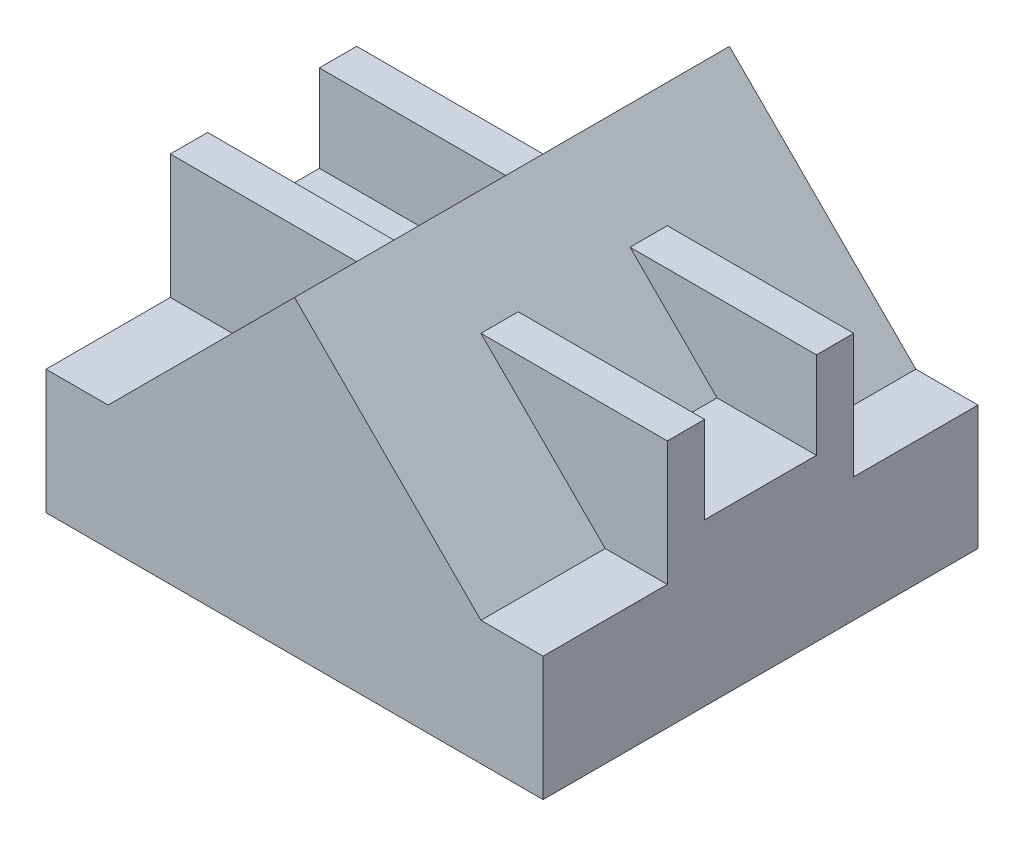
ISO-10303-21;
HEADER;
FILE_DESCRIPTION(('STEP AP214'),'2;1');
FILE_NAME('part.step','',(''),(''),'','','');
FILE_SCHEMA(('AUTOMOTIVE_DESIGN { 1 0 10303 214 1 1 1 1 }'));
ENDSEC;
DATA;
#1=APPLICATION_CONTEXT('core data for automotive mechanical design processes');
#2=APPLICATION_PROTOCOL_DEFINITION('international standard','automotive_design',2000,#1);
#3=PRODUCT_CONTEXT('',#1,'mechanical');
#4=PRODUCT('Part','Part','',(#3));
#5=PRODUCT_RELATED_PRODUCT_CATEGORY('part','',(#4));
#6=PRODUCT_DEFINITION_FORMATION('','',#4);
#7=PRODUCT_DEFINITION_CONTEXT('part definition',#1,'design');
#8=PRODUCT_DEFINITION('design','',#6,#7);
#9=PRODUCT_DEFINITION_SHAPE('','',#8);
#10=(LENGTH_UNIT() NAMED_UNIT(*) SI_UNIT(.MILLI.,.METRE.));
#11=(NAMED_UNIT(*) PLANE_ANGLE_UNIT() SI_UNIT($,.RADIAN.));
#12=(NAMED_UNIT(*) SI_UNIT($,.STERADIAN.) SOLID_ANGLE_UNIT());
#13=UNCERTAINTY_MEASURE_WITH_UNIT(LENGTH_MEASURE(1.E-05),#10,'distance_accuracy_value','');
#14=(GEOMETRIC_REPRESENTATION_CONTEXT(3) GLOBAL_UNCERTAINTY_ASSIGNED_CONTEXT((#13)) GLOBAL_UNIT_ASSIGNED_CONTEXT((#10,
#11,#12)) REPRESENTATION_CONTEXT('',''));
#15=CARTESIAN_POINT('',(0.,0.,0.));
#16=DIRECTION('',(0.,0.,1.));
#17=DIRECTION('',(1.,0.,0.));
#18=AXIS2_PLACEMENT_3D('',#15,#16,#17);
#19=CARTESIAN_POINT('',(74.9999999999992,25.,175.));
#20=DIRECTION('',(0.,-1.,0.));
#21=DIRECTION('',(1.,0.,0.));
#22=AXIS2_PLACEMENT_3D('',#19,#20,#21);
#23=PLANE('',#22);
#24=DIRECTION('',(0.,0.,-1.));
#25=VECTOR('',#24,1.);
#26=CARTESIAN_POINT('',(100.,25.,175.));
#27=LINE('',#26,#25);
#28=CARTESIAN_POINT('',(100.,25.,175.));
#29=VERTEX_POINT('',#28);
#30=CARTESIAN_POINT('',(100.,25.,125.));
#31=VERTEX_POINT('',#30);
#32=EDGE_CURVE('E409',#29,#31,#27,.T.);
#33=ORIENTED_EDGE('',*,*,#32,.T.);
#34=DIRECTION('',(1.,0.,0.));
#35=VECTOR('',#34,1.);
#36=CARTESIAN_POINT('',(-100.,25.,125.));
#37=LINE('',#36,#35);
#38=CARTESIAN_POINT('',(74.9999999999992,25.,125.));
#39=VERTEX_POINT('',#38);
#40=EDGE_CURVE('E275',#39,#31,#37,.T.);
#41=ORIENTED_EDGE('',*,*,#40,.F.);
#42=DIRECTION('',(0.,0.,-1.));
#43=VECTOR('',#42,1.);
#44=CARTESIAN_POINT('',(74.9999999999992,25.,175.));
#45=LINE('',#44,#43);
#46=CARTESIAN_POINT('',(74.9999999999992,25.,175.));
#47=VERTEX_POINT('',#46);
#48=EDGE_CURVE('E404',#47,#39,#45,.T.);
#49=ORIENTED_EDGE('',*,*,#48,.F.);
#50=DIRECTION('',(-1.,0.,0.));
#51=VECTOR('',#50,1.);
#52=CARTESIAN_POINT('',(74.9999999999992,25.,175.));
#53=LINE('',#52,#51);
#54=EDGE_CURVE('E339',#29,#47,#53,.T.);
#55=ORIENTED_EDGE('',*,*,#54,.F.);
#56=EDGE_LOOP('',(#33,#41,#49,#55));
#57=FACE_BOUND('',#56,.T.);
#58=ADVANCED_FACE('F43',(#57),#23,.F.);
#59=CARTESIAN_POINT('',(-100.,25.,175.));
#60=DIRECTION('',(0.,-1.,0.));
#61=DIRECTION('',(1.,0.,0.));
#62=AXIS2_PLACEMENT_3D('',#59,#60,#61);
#63=PLANE('',#62);
#64=DIRECTION('',(0.,0.,-1.));
#65=VECTOR('',#64,1.);
#66=CARTESIAN_POINT('',(-74.9999999999992,25.,175.));
#67=LINE('',#66,#65);
#68=CARTESIAN_POINT('',(-74.9999999999992,25.,175.));
#69=VERTEX_POINT('',#68);
#70=CARTESIAN_POINT('',(-74.9999999999992,25.,125.));
#71=VERTEX_POINT('',#70);
#72=EDGE_CURVE('E395',#69,#71,#67,.T.);
#73=ORIENTED_EDGE('',*,*,#72,.T.);
#74=CARTESIAN_POINT('',(-100.,25.,125.));
#75=VERTEX_POINT('',#74);
#76=EDGE_CURVE('E271',#75,#71,#37,.T.);
#77=ORIENTED_EDGE('',*,*,#76,.F.);
#78=DIRECTION('',(0.,0.,-1.));
#79=VECTOR('',#78,1.);
#80=CARTESIAN_POINT('',(-100.,25.,175.));
#81=LINE('',#80,#79);
#82=CARTESIAN_POINT('',(-100.,25.,175.));
#83=VERTEX_POINT('',#82);
#84=EDGE_CURVE('E390',#83,#75,#81,.T.);
#85=ORIENTED_EDGE('',*,*,#84,.F.);
#86=DIRECTION('',(-1.,0.,0.));
#87=VECTOR('',#86,1.);
#88=CARTESIAN_POINT('',(-100.,25.,175.));
#89=LINE('',#88,#87);
#90=EDGE_CURVE('E349',#69,#83,#89,.T.);
#91=ORIENTED_EDGE('',*,*,#90,.F.);
#92=EDGE_LOOP('',(#73,#77,#85,#91));
#93=FACE_BOUND('',#92,.T.);
#94=ADVANCED_FACE('F511',(#93),#63,.F.);
#95=CARTESIAN_POINT('',(100.,25.,175.));
#96=DIRECTION('',(-1.,0.,0.));
#97=DIRECTION('',(0.,0.,1.));
#98=AXIS2_PLACEMENT_3D('',#95,#96,#97);
#99=PLANE('',#98);
#100=DIRECTION('',(0.,1.,0.));
#101=VECTOR('',#100,1.);
#102=CARTESIAN_POINT('',(100.,25.,0.));
#103=LINE('',#102,#101);
#104=CARTESIAN_POINT('',(100.,-25.,0.));
#105=VERTEX_POINT('',#104);
#106=CARTESIAN_POINT('',(100.,25.,0.));
#107=VERTEX_POINT('',#106);
#108=EDGE_CURVE('E334',#105,#107,#103,.T.);
#109=ORIENTED_EDGE('',*,*,#108,.T.);
#110=CARTESIAN_POINT('',(100.,25.,50.));
#111=VERTEX_POINT('',#110);
#112=EDGE_CURVE('E408',#111,#107,#27,.T.);
#113=ORIENTED_EDGE('',*,*,#112,.F.);
#114=DIRECTION('',(0.,1.,0.));
#115=VECTOR('',#114,1.);
#116=CARTESIAN_POINT('',(100.,75.,50.));
#117=LINE('',#116,#115);
#118=CARTESIAN_POINT('',(100.,75.,50.));
#119=VERTEX_POINT('',#118);
#120=EDGE_CURVE('E248',#111,#119,#117,.T.);
#121=ORIENTED_EDGE('',*,*,#120,.T.);
#122=DIRECTION('',(0.,0.,1.));
#123=VECTOR('',#122,1.);
#124=CARTESIAN_POINT('',(100.,75.,65.));
#125=LINE('',#124,#123);
#126=CARTESIAN_POINT('',(100.,75.,65.));
#127=VERTEX_POINT('',#126);
#128=EDGE_CURVE('E252',#119,#127,#125,.T.);
#129=ORIENTED_EDGE('',*,*,#128,.T.);
#130=DIRECTION('',(0.,-1.,0.));
#131=VECTOR('',#130,1.);
#132=CARTESIAN_POINT('',(100.,40.,65.));
#133=LINE('',#132,#131);
#134=CARTESIAN_POINT('',(100.,40.,65.));
#135=VERTEX_POINT('',#134);
#136=EDGE_CURVE('E256',#127,#135,#133,.T.);
#137=ORIENTED_EDGE('',*,*,#136,.T.);
#138=DIRECTION('',(0.,0.,1.));
#139=VECTOR('',#138,1.);
#140=CARTESIAN_POINT('',(100.,40.,110.));
#141=LINE('',#140,#139);
#142=CARTESIAN_POINT('',(100.,40.,110.));
#143=VERTEX_POINT('',#142);
#144=EDGE_CURVE('E260',#135,#143,#141,.T.);
#145=ORIENTED_EDGE('',*,*,#144,.T.);
#146=DIRECTION('',(0.,1.,0.));
#147=VECTOR('',#146,1.);
#148=CARTESIAN_POINT('',(100.,75.,110.));
#149=LINE('',#148,#147);
#150=CARTESIAN_POINT('',(100.,75.,110.));
#151=VERTEX_POINT('',#150);
#152=EDGE_CURVE('E264',#143,#151,#149,.T.);
#153=ORIENTED_EDGE('',*,*,#152,.T.);
#154=DIRECTION('',(0.,0.,1.));
#155=VECTOR('',#154,1.);
#156=CARTESIAN_POINT('',(100.,75.,125.));
#157=LINE('',#156,#155);
#158=CARTESIAN_POINT('',(100.,75.,125.));
#159=VERTEX_POINT('',#158);
#160=EDGE_CURVE('E228',#151,#159,#157,.T.);
#161=ORIENTED_EDGE('',*,*,#160,.T.);
#162=DIRECTION('',(0.,-1.,0.));
#163=VECTOR('',#162,1.);
#164=CARTESIAN_POINT('',(100.,25.,125.));
#165=LINE('',#164,#163);
#166=EDGE_CURVE('E224',#159,#31,#165,.T.);
#167=ORIENTED_EDGE('',*,*,#166,.T.);
#168=ORIENTED_EDGE('',*,*,#32,.F.);
#169=DIRECTION('',(0.,1.,0.));
#170=VECTOR('',#169,1.);
#171=CARTESIAN_POINT('',(100.,25.,175.));
#172=LINE('',#171,#170);
#173=CARTESIAN_POINT('',(100.,-25.,175.));
#174=VERTEX_POINT('',#173);
#175=EDGE_CURVE('E335',#174,#29,#172,.T.);
#176=ORIENTED_EDGE('',*,*,#175,.F.);
#177=DIRECTION('',(0.,0.,-1.));
#178=VECTOR('',#177,1.);
#179=CARTESIAN_POINT('',(100.,-25.,175.));
#180=LINE('',#179,#178);
#181=EDGE_CURVE('E358',#174,#105,#180,.T.);
#182=ORIENTED_EDGE('',*,*,#181,.T.);
#183=EDGE_LOOP('',(#109,#113,#121,#129,#137,#145,#153,#161,#167,#168,#176,#182));
#184=FACE_BOUND('',#183,.T.);
#185=ADVANCED_FACE('F45',(#184),#99,.F.);
#186=CARTESIAN_POINT('',(74.9999999999992,25.,50.));
#187=VERTEX_POINT('',#186);
#188=CARTESIAN_POINT('',(74.9999999999992,25.,0.));
#189=VERTEX_POINT('',#188);
#190=EDGE_CURVE('E403',#187,#189,#45,.T.);
#191=ORIENTED_EDGE('',*,*,#190,.F.);
#192=DIRECTION('',(1.,0.,0.));
#193=VECTOR('',#192,1.);
#194=CARTESIAN_POINT('',(-100.,25.,50.));
#195=LINE('',#194,#193);
#196=EDGE_CURVE('E59',#187,#111,#195,.T.);
#197=ORIENTED_EDGE('',*,*,#196,.T.);
#198=ORIENTED_EDGE('',*,*,#112,.T.);
#199=DIRECTION('',(-1.,0.,0.));
#200=VECTOR('',#199,1.);
#201=CARTESIAN_POINT('',(74.9999999999992,25.,0.));
#202=LINE('',#201,#200);
#203=EDGE_CURVE('E362',#107,#189,#202,.T.);
#204=ORIENTED_EDGE('',*,*,#203,.T.);
#205=EDGE_LOOP('',(#191,#197,#198,#204));
#206=FACE_BOUND('',#205,.T.);
#207=ADVANCED_FACE('F452',(#206),#23,.F.);
#208=CARTESIAN_POINT('',(0.,100.,175.));
#209=DIRECTION('',(-0.707106781186551,-0.707106781186544,0.));
#210=DIRECTION('',(0.707106781186544,-0.707106781186551,0.));
#211=AXIS2_PLACEMENT_3D('',#208,#209,#210);
#212=PLANE('',#211);
#213=ORIENTED_EDGE('',*,*,#48,.T.);
#214=DIRECTION('',(-0.707106781186544,0.707106781186551,0.));
#215=VECTOR('',#214,1.);
#216=CARTESIAN_POINT('',(0.,100.,125.));
#217=LINE('',#216,#215);
#218=CARTESIAN_POINT('',(24.9999999999998,75.,125.));
#219=VERTEX_POINT('',#218);
#220=EDGE_CURVE('E310',#39,#219,#217,.T.);
#221=ORIENTED_EDGE('',*,*,#220,.T.);
#222=DIRECTION('',(0.,0.,-1.));
#223=VECTOR('',#222,1.);
#224=CARTESIAN_POINT('',(24.9999999999998,75.,175.));
#225=LINE('',#224,#223);
#226=CARTESIAN_POINT('',(24.9999999999997,75.,110.));
#227=VERTEX_POINT('',#226);
#228=EDGE_CURVE('E330',#219,#227,#225,.T.);
#229=ORIENTED_EDGE('',*,*,#228,.T.);
#230=DIRECTION('',(0.707106781186544,-0.707106781186551,0.));
#231=VECTOR('',#230,1.);
#232=CARTESIAN_POINT('',(0.,100.,110.));
#233=LINE('',#232,#231);
#234=CARTESIAN_POINT('',(59.9999999999994,40.,110.));
#235=VERTEX_POINT('',#234);
#236=EDGE_CURVE('E326',#227,#235,#233,.T.);
#237=ORIENTED_EDGE('',*,*,#236,.T.);
#238=DIRECTION('',(0.,0.,-1.));
#239=VECTOR('',#238,1.);
#240=CARTESIAN_POINT('',(59.9999999999994,40.,175.));
#241=LINE('',#240,#239);
#242=CARTESIAN_POINT('',(59.9999999999994,40.,65.));
#243=VERTEX_POINT('',#242);
#244=EDGE_CURVE('E322',#235,#243,#241,.T.);
#245=ORIENTED_EDGE('',*,*,#244,.T.);
#246=DIRECTION('',(-0.707106781186544,0.707106781186551,0.));
#247=VECTOR('',#246,1.);
#248=CARTESIAN_POINT('',(0.,100.,65.));
#249=LINE('',#248,#247);
#250=CARTESIAN_POINT('',(24.9999999999998,75.,65.));
#251=VERTEX_POINT('',#250);
#252=EDGE_CURVE('E318',#243,#251,#249,.T.);
#253=ORIENTED_EDGE('',*,*,#252,.T.);
#254=DIRECTION('',(0.,0.,-1.));
#255=VECTOR('',#254,1.);
#256=CARTESIAN_POINT('',(24.9999999999998,75.,175.));
#257=LINE('',#256,#255);
#258=CARTESIAN_POINT('',(24.9999999999998,75.,50.));
#259=VERTEX_POINT('',#258);
#260=EDGE_CURVE('E314',#251,#259,#257,.T.);
#261=ORIENTED_EDGE('',*,*,#260,.T.);
#262=DIRECTION('',(0.707106781186544,-0.707106781186551,0.));
#263=VECTOR('',#262,1.);
#264=CARTESIAN_POINT('',(0.,100.,50.));
#265=LINE('',#264,#263);
#266=EDGE_CURVE('E303',#259,#187,#265,.T.);
#267=ORIENTED_EDGE('',*,*,#266,.T.);
#268=ORIENTED_EDGE('',*,*,#190,.T.);
#269=DIRECTION('',(-0.707106781186544,0.707106781186551,0.));
#270=VECTOR('',#269,1.);
#271=CARTESIAN_POINT('',(0.,100.,0.));
#272=LINE('',#271,#270);
#273=CARTESIAN_POINT('',(0.,100.,0.));
#274=VERTEX_POINT('',#273);
#275=EDGE_CURVE('E366',#189,#274,#272,.T.);
#276=ORIENTED_EDGE('',*,*,#275,.T.);
#277=DIRECTION('',(0.,0.,-1.));
#278=VECTOR('',#277,1.);
#279=CARTESIAN_POINT('',(0.,100.,175.));
#280=LINE('',#279,#278);
#281=CARTESIAN_POINT('',(0.,100.,175.));
#282=VERTEX_POINT('',#281);
#283=EDGE_CURVE('E399',#282,#274,#280,.T.);
#284=ORIENTED_EDGE('',*,*,#283,.F.);
#285=DIRECTION('',(-0.707106781186544,0.707106781186551,0.));
#286=VECTOR('',#285,1.);
#287=CARTESIAN_POINT('',(0.,100.,175.));
#288=LINE('',#287,#286);
#289=EDGE_CURVE('E343',#47,#282,#288,.T.);
#290=ORIENTED_EDGE('',*,*,#289,.F.);
#291=EDGE_LOOP('',(#213,#221,#229,#237,#245,#253,#261,#267,#268,#276,#284,#290));
#292=FACE_BOUND('',#291,.T.);
#293=ADVANCED_FACE('F459',(#292),#212,.F.);
#294=CARTESIAN_POINT('',(0.,100.,175.));
#295=DIRECTION('',(0.707106781186551,-0.707106781186544,0.));
#296=DIRECTION('',(0.707106781186544,0.707106781186551,0.));
#297=AXIS2_PLACEMENT_3D('',#294,#295,#296);
#298=PLANE('',#297);
#299=DIRECTION('',(0.,0.,1.));
#300=VECTOR('',#299,1.);
#301=CARTESIAN_POINT('',(-24.9999999999997,75.,175.));
#302=LINE('',#301,#300);
#303=CARTESIAN_POINT('',(-24.9999999999997,75.,110.));
#304=VERTEX_POINT('',#303);
#305=CARTESIAN_POINT('',(-24.9999999999997,75.,125.));
#306=VERTEX_POINT('',#305);
#307=EDGE_CURVE('E11',#304,#306,#302,.T.);
#308=ORIENTED_EDGE('',*,*,#307,.T.);
#309=DIRECTION('',(-0.707106781186544,-0.707106781186551,0.));
#310=VECTOR('',#309,1.);
#311=CARTESIAN_POINT('',(0.,100.,125.));
#312=LINE('',#311,#310);
#313=EDGE_CURVE('E306',#306,#71,#312,.T.);
#314=ORIENTED_EDGE('',*,*,#313,.T.);
#315=ORIENTED_EDGE('',*,*,#72,.F.);
#316=DIRECTION('',(-0.707106781186544,-0.707106781186551,0.));
#317=VECTOR('',#316,1.);
#318=CARTESIAN_POINT('',(0.,100.,175.));
#319=LINE('',#318,#317);
#320=EDGE_CURVE('E346',#282,#69,#319,.T.);
#321=ORIENTED_EDGE('',*,*,#320,.F.);
#322=ORIENTED_EDGE('',*,*,#283,.T.);
#323=DIRECTION('',(-0.707106781186544,-0.707106781186551,0.));
#324=VECTOR('',#323,1.);
#325=CARTESIAN_POINT('',(0.,100.,0.));
#326=LINE('',#325,#324);
#327=CARTESIAN_POINT('',(-74.9999999999992,25.,0.));
#328=VERTEX_POINT('',#327);
#329=EDGE_CURVE('E369',#274,#328,#326,.T.);
#330=ORIENTED_EDGE('',*,*,#329,.T.);
#331=CARTESIAN_POINT('',(-74.9999999999992,25.,50.));
#332=VERTEX_POINT('',#331);
#333=EDGE_CURVE('E394',#332,#328,#67,.T.);
#334=ORIENTED_EDGE('',*,*,#333,.F.);
#335=DIRECTION('',(0.707106781186544,0.707106781186551,0.));
#336=VECTOR('',#335,1.);
#337=CARTESIAN_POINT('',(0.,100.,50.));
#338=LINE('',#337,#336);
#339=CARTESIAN_POINT('',(-24.9999999999997,75.,50.));
#340=VERTEX_POINT('',#339);
#341=EDGE_CURVE('E274',#332,#340,#338,.T.);
#342=ORIENTED_EDGE('',*,*,#341,.T.);
#343=DIRECTION('',(0.,0.,1.));
#344=VECTOR('',#343,1.);
#345=CARTESIAN_POINT('',(-24.9999999999997,75.,175.));
#346=LINE('',#345,#344);
#347=CARTESIAN_POINT('',(-24.9999999999997,75.,65.));
#348=VERTEX_POINT('',#347);
#349=EDGE_CURVE('E205',#340,#348,#346,.T.);
#350=ORIENTED_EDGE('',*,*,#349,.T.);
#351=DIRECTION('',(-0.707106781186544,-0.707106781186551,0.));
#352=VECTOR('',#351,1.);
#353=CARTESIAN_POINT('',(0.,100.,65.));
#354=LINE('',#353,#352);
#355=CARTESIAN_POINT('',(-59.9999999999993,40.,65.));
#356=VERTEX_POINT('',#355);
#357=EDGE_CURVE('E415',#348,#356,#354,.T.);
#358=ORIENTED_EDGE('',*,*,#357,.T.);
#359=DIRECTION('',(0.,0.,1.));
#360=VECTOR('',#359,1.);
#361=CARTESIAN_POINT('',(-59.9999999999993,40.,175.));
#362=LINE('',#361,#360);
#363=CARTESIAN_POINT('',(-59.9999999999993,40.,110.));
#364=VERTEX_POINT('',#363);
#365=EDGE_CURVE('E419',#356,#364,#362,.T.);
#366=ORIENTED_EDGE('',*,*,#365,.T.);
#367=DIRECTION('',(0.707106781186544,0.707106781186551,0.));
#368=VECTOR('',#367,1.);
#369=CARTESIAN_POINT('',(0.,100.,110.));
#370=LINE('',#369,#368);
#371=EDGE_CURVE('E52',#364,#304,#370,.T.);
#372=ORIENTED_EDGE('',*,*,#371,.T.);
#373=EDGE_LOOP('',(#308,#314,#315,#321,#322,#330,#334,#342,#350,#358,#366,#372));
#374=FACE_BOUND('',#373,.T.);
#375=ADVANCED_FACE('F425',(#374),#298,.F.);
#376=CARTESIAN_POINT('',(-100.,25.,50.));
#377=VERTEX_POINT('',#376);
#378=CARTESIAN_POINT('',(-100.,25.,0.));
#379=VERTEX_POINT('',#378);
#380=EDGE_CURVE('E389',#377,#379,#81,.T.);
#381=ORIENTED_EDGE('',*,*,#380,.F.);
#382=EDGE_CURVE('E221',#377,#332,#195,.T.);
#383=ORIENTED_EDGE('',*,*,#382,.T.);
#384=ORIENTED_EDGE('',*,*,#333,.T.);
#385=DIRECTION('',(-1.,0.,0.));
#386=VECTOR('',#385,1.);
#387=CARTESIAN_POINT('',(-100.,25.,0.));
#388=LINE('',#387,#386);
#389=EDGE_CURVE('E373',#328,#379,#388,.T.);
#390=ORIENTED_EDGE('',*,*,#389,.T.);
#391=EDGE_LOOP('',(#381,#383,#384,#390));
#392=FACE_BOUND('',#391,.T.);
#393=ADVANCED_FACE('F436',(#392),#63,.F.);
#394=CARTESIAN_POINT('',(-100.,25.,175.));
#395=DIRECTION('',(1.,0.,0.));
#396=DIRECTION('',(0.,0.,-1.));
#397=AXIS2_PLACEMENT_3D('',#394,#395,#396);
#398=PLANE('',#397);
#399=DIRECTION('',(0.,-1.,0.));
#400=VECTOR('',#399,1.);
#401=CARTESIAN_POINT('',(-100.,25.,0.));
#402=LINE('',#401,#400);
#403=CARTESIAN_POINT('',(-100.,-25.,0.));
#404=VERTEX_POINT('',#403);
#405=EDGE_CURVE('E377',#379,#404,#402,.T.);
#406=ORIENTED_EDGE('',*,*,#405,.T.);
#407=DIRECTION('',(0.,0.,-1.));
#408=VECTOR('',#407,1.);
#409=CARTESIAN_POINT('',(-100.,-25.,175.));
#410=LINE('',#409,#408);
#411=CARTESIAN_POINT('',(-100.,-25.,175.));
#412=VERTEX_POINT('',#411);
#413=EDGE_CURVE('E385',#412,#404,#410,.T.);
#414=ORIENTED_EDGE('',*,*,#413,.F.);
#415=DIRECTION('',(0.,-1.,0.));
#416=VECTOR('',#415,1.);
#417=CARTESIAN_POINT('',(-100.,25.,175.));
#418=LINE('',#417,#416);
#419=EDGE_CURVE('E352',#83,#412,#418,.T.);
#420=ORIENTED_EDGE('',*,*,#419,.F.);
#421=ORIENTED_EDGE('',*,*,#84,.T.);
#422=DIRECTION('',(0.,-1.,0.));
#423=VECTOR('',#422,1.);
#424=CARTESIAN_POINT('',(-100.,25.,125.));
#425=LINE('',#424,#423);
#426=CARTESIAN_POINT('',(-100.,75.,125.));
#427=VERTEX_POINT('',#426);
#428=EDGE_CURVE('E245',#427,#75,#425,.T.);
#429=ORIENTED_EDGE('',*,*,#428,.F.);
#430=DIRECTION('',(0.,0.,1.));
#431=VECTOR('',#430,1.);
#432=CARTESIAN_POINT('',(-100.,75.,125.));
#433=LINE('',#432,#431);
#434=CARTESIAN_POINT('',(-100.,75.,110.));
#435=VERTEX_POINT('',#434);
#436=EDGE_CURVE('E241',#435,#427,#433,.T.);
#437=ORIENTED_EDGE('',*,*,#436,.F.);
#438=DIRECTION('',(0.,1.,0.));
#439=VECTOR('',#438,1.);
#440=CARTESIAN_POINT('',(-100.,75.,110.));
#441=LINE('',#440,#439);
#442=CARTESIAN_POINT('',(-100.,40.,110.));
#443=VERTEX_POINT('',#442);
#444=EDGE_CURVE('E237',#443,#435,#441,.T.);
#445=ORIENTED_EDGE('',*,*,#444,.F.);
#446=DIRECTION('',(0.,0.,1.));
#447=VECTOR('',#446,1.);
#448=CARTESIAN_POINT('',(-100.,40.,110.));
#449=LINE('',#448,#447);
#450=CARTESIAN_POINT('',(-100.,40.,65.));
#451=VERTEX_POINT('',#450);
#452=EDGE_CURVE('E233',#451,#443,#449,.T.);
#453=ORIENTED_EDGE('',*,*,#452,.F.);
#454=DIRECTION('',(0.,-1.,0.));
#455=VECTOR('',#454,1.);
#456=CARTESIAN_POINT('',(-100.,40.,65.));
#457=LINE('',#456,#455);
#458=CARTESIAN_POINT('',(-100.,75.,65.));
#459=VERTEX_POINT('',#458);
#460=EDGE_CURVE('E216',#459,#451,#457,.T.);
#461=ORIENTED_EDGE('',*,*,#460,.F.);
#462=DIRECTION('',(0.,0.,1.));
#463=VECTOR('',#462,1.);
#464=CARTESIAN_POINT('',(-100.,75.,65.));
#465=LINE('',#464,#463);
#466=CARTESIAN_POINT('',(-100.,75.,50.));
#467=VERTEX_POINT('',#466);
#468=EDGE_CURVE('E203',#467,#459,#465,.T.);
#469=ORIENTED_EDGE('',*,*,#468,.F.);
#470=DIRECTION('',(0.,1.,0.));
#471=VECTOR('',#470,1.);
#472=CARTESIAN_POINT('',(-100.,75.,50.));
#473=LINE('',#472,#471);
#474=EDGE_CURVE('E67',#377,#467,#473,.T.);
#475=ORIENTED_EDGE('',*,*,#474,.F.);
#476=ORIENTED_EDGE('',*,*,#380,.T.);
#477=EDGE_LOOP('',(#406,#414,#420,#421,#429,#437,#445,#453,#461,#469,#475,#476));
#478=FACE_BOUND('',#477,.T.);
#479=ADVANCED_FACE('F213',(#478),#398,.F.);
#480=CARTESIAN_POINT('',(-100.,-25.,175.));
#481=DIRECTION('',(0.,1.,0.));
#482=DIRECTION('',(0.,0.,1.));
#483=AXIS2_PLACEMENT_3D('',#480,#481,#482);
#484=PLANE('',#483);
#485=DIRECTION('',(1.,0.,0.));
#486=VECTOR('',#485,1.);
#487=CARTESIAN_POINT('',(-100.,-25.,0.));
#488=LINE('',#487,#486);
#489=EDGE_CURVE('E340',#404,#105,#488,.T.);
#490=ORIENTED_EDGE('',*,*,#489,.T.);
#491=ORIENTED_EDGE('',*,*,#181,.F.);
#492=DIRECTION('',(1.,0.,0.));
#493=VECTOR('',#492,1.);
#494=CARTESIAN_POINT('',(-100.,-25.,175.));
#495=LINE('',#494,#493);
#496=EDGE_CURVE('E355',#412,#174,#495,.T.);
#497=ORIENTED_EDGE('',*,*,#496,.F.);
#498=ORIENTED_EDGE('',*,*,#413,.T.);
#499=EDGE_LOOP('',(#490,#491,#497,#498));
#500=FACE_BOUND('',#499,.T.);
#501=ADVANCED_FACE('F552',(#500),#484,.F.);
#502=CARTESIAN_POINT('',(0.,0.,175.));
#503=DIRECTION('',(0.,0.,1.));
#504=DIRECTION('',(1.,0.,0.));
#505=AXIS2_PLACEMENT_3D('',#502,#503,#504);
#506=PLANE('',#505);
#507=ORIENTED_EDGE('',*,*,#175,.T.);
#508=ORIENTED_EDGE('',*,*,#54,.T.);
#509=ORIENTED_EDGE('',*,*,#289,.T.);
#510=ORIENTED_EDGE('',*,*,#320,.T.);
#511=ORIENTED_EDGE('',*,*,#90,.T.);
#512=ORIENTED_EDGE('',*,*,#419,.T.);
#513=ORIENTED_EDGE('',*,*,#496,.T.);
#514=EDGE_LOOP('',(#507,#508,#509,#510,#511,#512,#513));
#515=FACE_BOUND('',#514,.T.);
#516=ADVANCED_FACE('F470',(#515),#506,.T.);
#517=CARTESIAN_POINT('',(0.,0.,0.));
#518=DIRECTION('',(0.,0.,1.));
#519=DIRECTION('',(1.,0.,0.));
#520=AXIS2_PLACEMENT_3D('',#517,#518,#519);
#521=PLANE('',#520);
#522=ORIENTED_EDGE('',*,*,#108,.F.);
#523=ORIENTED_EDGE('',*,*,#489,.F.);
#524=ORIENTED_EDGE('',*,*,#405,.F.);
#525=ORIENTED_EDGE('',*,*,#389,.F.);
#526=ORIENTED_EDGE('',*,*,#329,.F.);
#527=ORIENTED_EDGE('',*,*,#275,.F.);
#528=ORIENTED_EDGE('',*,*,#203,.F.);
#529=EDGE_LOOP('',(#522,#523,#524,#525,#526,#527,#528));
#530=FACE_BOUND('',#529,.T.);
#531=ADVANCED_FACE('F464',(#530),#521,.F.);
#532=CARTESIAN_POINT('',(-100.,75.,50.));
#533=DIRECTION('',(0.,0.,-1.));
#534=DIRECTION('',(0.,1.,0.));
#535=AXIS2_PLACEMENT_3D('',#532,#533,#534);
#536=PLANE('',#535);
#537=ORIENTED_EDGE('',*,*,#341,.F.);
#538=ORIENTED_EDGE('',*,*,#382,.F.);
#539=ORIENTED_EDGE('',*,*,#474,.T.);
#540=DIRECTION('',(1.,0.,0.));
#541=VECTOR('',#540,1.);
#542=CARTESIAN_POINT('',(-100.,75.,50.));
#543=LINE('',#542,#541);
#544=EDGE_CURVE('E200',#467,#340,#543,.T.);
#545=ORIENTED_EDGE('',*,*,#544,.T.);
#546=EDGE_LOOP('',(#537,#538,#539,#545));
#547=FACE_BOUND('',#546,.T.);
#548=ADVANCED_FACE('F219',(#547),#536,.T.);
#549=CARTESIAN_POINT('',(-100.,25.,125.));
#550=DIRECTION('',(0.,0.,1.));
#551=DIRECTION('',(1.,0.,0.));
#552=AXIS2_PLACEMENT_3D('',#549,#550,#551);
#553=PLANE('',#552);
#554=ORIENTED_EDGE('',*,*,#313,.F.);
#555=DIRECTION('',(1.,0.,0.));
#556=VECTOR('',#555,1.);
#557=CARTESIAN_POINT('',(-100.,75.,125.));
#558=LINE('',#557,#556);
#559=EDGE_CURVE('E276',#427,#306,#558,.T.);
#560=ORIENTED_EDGE('',*,*,#559,.F.);
#561=ORIENTED_EDGE('',*,*,#428,.T.);
#562=ORIENTED_EDGE('',*,*,#76,.T.);
#563=EDGE_LOOP('',(#554,#560,#561,#562));
#564=FACE_BOUND('',#563,.T.);
#565=ADVANCED_FACE('F506',(#564),#553,.T.);
#566=CARTESIAN_POINT('',(-100.,75.,65.));
#567=DIRECTION('',(0.,1.,0.));
#568=DIRECTION('',(0.,0.,1.));
#569=AXIS2_PLACEMENT_3D('',#566,#567,#568);
#570=PLANE('',#569);
#571=ORIENTED_EDGE('',*,*,#349,.F.);
#572=ORIENTED_EDGE('',*,*,#544,.F.);
#573=ORIENTED_EDGE('',*,*,#468,.T.);
#574=DIRECTION('',(1.,0.,0.));
#575=VECTOR('',#574,1.);
#576=CARTESIAN_POINT('',(-100.,75.,65.));
#577=LINE('',#576,#575);
#578=EDGE_CURVE('E296',#459,#348,#577,.T.);
#579=ORIENTED_EDGE('',*,*,#578,.T.);
#580=EDGE_LOOP('',(#571,#572,#573,#579));
#581=FACE_BOUND('',#580,.T.);
#582=ADVANCED_FACE('F201',(#581),#570,.T.);
#583=CARTESIAN_POINT('',(-100.,40.,65.));
#584=DIRECTION('',(0.,0.,1.));
#585=DIRECTION('',(1.,0.,0.));
#586=AXIS2_PLACEMENT_3D('',#583,#584,#585);
#587=PLANE('',#586);
#588=ORIENTED_EDGE('',*,*,#357,.F.);
#589=ORIENTED_EDGE('',*,*,#578,.F.);
#590=ORIENTED_EDGE('',*,*,#460,.T.);
#591=DIRECTION('',(1.,0.,0.));
#592=VECTOR('',#591,1.);
#593=CARTESIAN_POINT('',(-100.,40.,65.));
#594=LINE('',#593,#592);
#595=EDGE_CURVE('E291',#451,#356,#594,.T.);
#596=ORIENTED_EDGE('',*,*,#595,.T.);
#597=EDGE_LOOP('',(#588,#589,#590,#596));
#598=FACE_BOUND('',#597,.T.);
#599=ADVANCED_FACE('F433',(#598),#587,.T.);
#600=CARTESIAN_POINT('',(-100.,40.,110.));
#601=DIRECTION('',(0.,1.,0.));
#602=DIRECTION('',(0.,0.,1.));
#603=AXIS2_PLACEMENT_3D('',#600,#601,#602);
#604=PLANE('',#603);
#605=ORIENTED_EDGE('',*,*,#365,.F.);
#606=ORIENTED_EDGE('',*,*,#595,.F.);
#607=ORIENTED_EDGE('',*,*,#452,.T.);
#608=DIRECTION('',(1.,0.,0.));
#609=VECTOR('',#608,1.);
#610=CARTESIAN_POINT('',(-100.,40.,110.));
#611=LINE('',#610,#609);
#612=EDGE_CURVE('E286',#443,#364,#611,.T.);
#613=ORIENTED_EDGE('',*,*,#612,.T.);
#614=EDGE_LOOP('',(#605,#606,#607,#613));
#615=FACE_BOUND('',#614,.T.);
#616=ADVANCED_FACE('F430',(#615),#604,.T.);
#617=CARTESIAN_POINT('',(-100.,75.,110.));
#618=DIRECTION('',(0.,0.,-1.));
#619=DIRECTION('',(-1.,0.,0.));
#620=AXIS2_PLACEMENT_3D('',#617,#618,#619);
#621=PLANE('',#620);
#622=ORIENTED_EDGE('',*,*,#371,.F.);
#623=ORIENTED_EDGE('',*,*,#612,.F.);
#624=ORIENTED_EDGE('',*,*,#444,.T.);
#625=DIRECTION('',(1.,0.,0.));
#626=VECTOR('',#625,1.);
#627=CARTESIAN_POINT('',(-100.,75.,110.));
#628=LINE('',#627,#626);
#629=EDGE_CURVE('E281',#435,#304,#628,.T.);
#630=ORIENTED_EDGE('',*,*,#629,.T.);
#631=EDGE_LOOP('',(#622,#623,#624,#630));
#632=FACE_BOUND('',#631,.T.);
#633=ADVANCED_FACE('F427',(#632),#621,.T.);
#634=CARTESIAN_POINT('',(-100.,75.,125.));
#635=DIRECTION('',(0.,1.,0.));
#636=DIRECTION('',(0.,0.,1.));
#637=AXIS2_PLACEMENT_3D('',#634,#635,#636);
#638=PLANE('',#637);
#639=ORIENTED_EDGE('',*,*,#307,.F.);
#640=ORIENTED_EDGE('',*,*,#629,.F.);
#641=ORIENTED_EDGE('',*,*,#436,.T.);
#642=ORIENTED_EDGE('',*,*,#559,.T.);
#643=EDGE_LOOP('',(#639,#640,#641,#642));
#644=FACE_BOUND('',#643,.T.);
#645=ADVANCED_FACE('F659',(#644),#638,.T.);
#646=ORIENTED_EDGE('',*,*,#228,.F.);
#647=EDGE_CURVE('E280',#219,#159,#558,.T.);
#648=ORIENTED_EDGE('',*,*,#647,.T.);
#649=ORIENTED_EDGE('',*,*,#160,.F.);
#650=EDGE_CURVE('E285',#227,#151,#628,.T.);
#651=ORIENTED_EDGE('',*,*,#650,.F.);
#652=EDGE_LOOP('',(#646,#648,#649,#651));
#653=FACE_BOUND('',#652,.T.);
#654=ADVANCED_FACE('F483',(#653),#638,.T.);
#655=ORIENTED_EDGE('',*,*,#236,.F.);
#656=ORIENTED_EDGE('',*,*,#650,.T.);
#657=ORIENTED_EDGE('',*,*,#152,.F.);
#658=EDGE_CURVE('E290',#235,#143,#611,.T.);
#659=ORIENTED_EDGE('',*,*,#658,.F.);
#660=EDGE_LOOP('',(#655,#656,#657,#659));
#661=FACE_BOUND('',#660,.T.);
#662=ADVANCED_FACE('F486',(#661),#621,.T.);
#663=ORIENTED_EDGE('',*,*,#244,.F.);
#664=ORIENTED_EDGE('',*,*,#658,.T.);
#665=ORIENTED_EDGE('',*,*,#144,.F.);
#666=EDGE_CURVE('E295',#243,#135,#594,.T.);
#667=ORIENTED_EDGE('',*,*,#666,.F.);
#668=EDGE_LOOP('',(#663,#664,#665,#667));
#669=FACE_BOUND('',#668,.T.);
#670=ADVANCED_FACE('F489',(#669),#604,.T.);
#671=ORIENTED_EDGE('',*,*,#252,.F.);
#672=ORIENTED_EDGE('',*,*,#666,.T.);
#673=ORIENTED_EDGE('',*,*,#136,.F.);
#674=EDGE_CURVE('E209',#251,#127,#577,.T.);
#675=ORIENTED_EDGE('',*,*,#674,.F.);
#676=EDGE_LOOP('',(#671,#672,#673,#675));
#677=FACE_BOUND('',#676,.T.);
#678=ADVANCED_FACE('F493',(#677),#587,.T.);
#679=ORIENTED_EDGE('',*,*,#260,.F.);
#680=ORIENTED_EDGE('',*,*,#674,.T.);
#681=ORIENTED_EDGE('',*,*,#128,.F.);
#682=EDGE_CURVE('E210',#259,#119,#543,.T.);
#683=ORIENTED_EDGE('',*,*,#682,.F.);
#684=EDGE_LOOP('',(#679,#680,#681,#683));
#685=FACE_BOUND('',#684,.T.);
#686=ADVANCED_FACE('F497',(#685),#570,.T.);
#687=ORIENTED_EDGE('',*,*,#220,.F.);
#688=ORIENTED_EDGE('',*,*,#40,.T.);
#689=ORIENTED_EDGE('',*,*,#166,.F.);
#690=ORIENTED_EDGE('',*,*,#647,.F.);
#691=EDGE_LOOP('',(#687,#688,#689,#690));
#692=FACE_BOUND('',#691,.T.);
#693=ADVANCED_FACE('F477',(#692),#553,.T.);
#694=ORIENTED_EDGE('',*,*,#266,.F.);
#695=ORIENTED_EDGE('',*,*,#682,.T.);
#696=ORIENTED_EDGE('',*,*,#120,.F.);
#697=ORIENTED_EDGE('',*,*,#196,.F.);
#698=EDGE_LOOP('',(#694,#695,#696,#697));
#699=FACE_BOUND('',#698,.T.);
#700=ADVANCED_FACE('F499',(#699),#536,.T.);
#701=CLOSED_SHELL('',(#58,#94,#185,#207,#293,#375,#393,#479,#501,#516,#531,#548,#565,#582,#599,
#616,#633,#645,#654,#662,#670,#678,#686,#693,#700));
#702=MANIFOLD_SOLID_BREP('B2',#701);
#703=ADVANCED_BREP_SHAPE_REPRESENTATION('',(#18,#702),#14);
#704=SHAPE_DEFINITION_REPRESENTATION(#9,#703);
ENDSEC;
END-ISO-10303-21;
